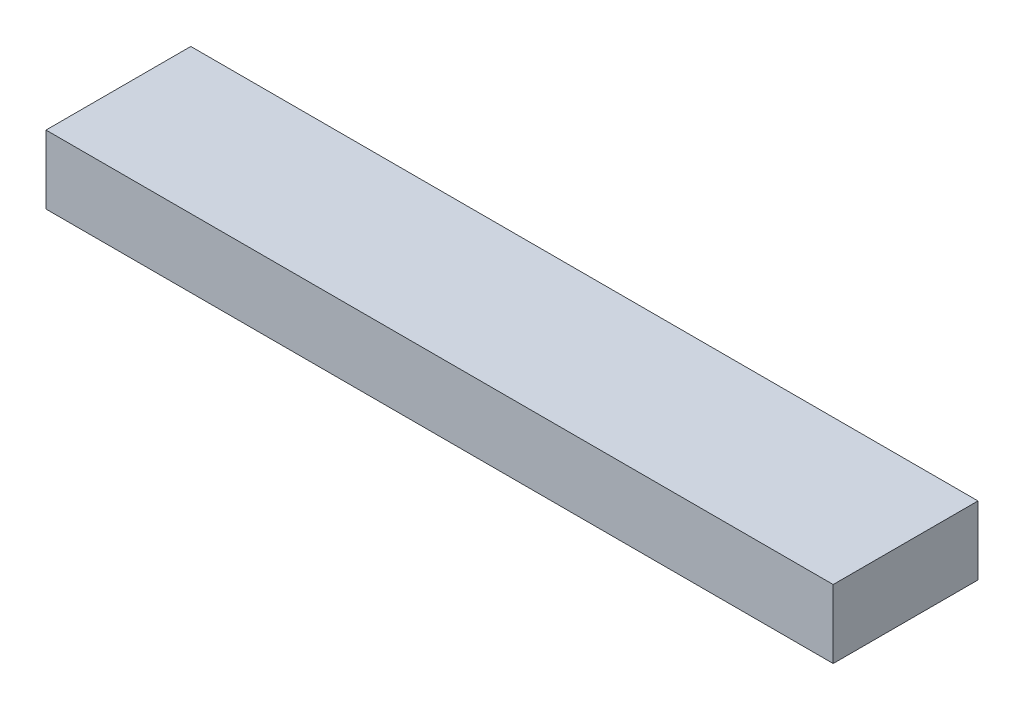
ISO-10303-21;
HEADER;
FILE_DESCRIPTION(('STEP AP214'),'2;1');
FILE_NAME('part.step','',(''),(''),'','','');
FILE_SCHEMA(('AUTOMOTIVE_DESIGN { 1 0 10303 214 1 1 1 1 }'));
ENDSEC;
DATA;
#1=APPLICATION_CONTEXT('core data for automotive mechanical design processes');
#2=APPLICATION_PROTOCOL_DEFINITION('international standard','automotive_design',2000,#1);
#3=PRODUCT_CONTEXT('',#1,'mechanical');
#4=PRODUCT('Part','Part','',(#3));
#5=PRODUCT_RELATED_PRODUCT_CATEGORY('part','',(#4));
#6=PRODUCT_DEFINITION_FORMATION('','',#4);
#7=PRODUCT_DEFINITION_CONTEXT('part definition',#1,'design');
#8=PRODUCT_DEFINITION('design','',#6,#7);
#9=PRODUCT_DEFINITION_SHAPE('','',#8);
#10=(LENGTH_UNIT() NAMED_UNIT(*) SI_UNIT(.MILLI.,.METRE.));
#11=(NAMED_UNIT(*) PLANE_ANGLE_UNIT() SI_UNIT($,.RADIAN.));
#12=(NAMED_UNIT(*) SI_UNIT($,.STERADIAN.) SOLID_ANGLE_UNIT());
#13=UNCERTAINTY_MEASURE_WITH_UNIT(LENGTH_MEASURE(1.E-05),#10,'distance_accuracy_value','');
#14=(GEOMETRIC_REPRESENTATION_CONTEXT(3) GLOBAL_UNCERTAINTY_ASSIGNED_CONTEXT((#13)) GLOBAL_UNIT_ASSIGNED_CONTEXT((#10,
#11,#12)) REPRESENTATION_CONTEXT('',''));
#15=CARTESIAN_POINT('',(0.,0.,0.));
#16=DIRECTION('',(0.,0.,1.));
#17=DIRECTION('',(1.,0.,0.));
#18=AXIS2_PLACEMENT_3D('',#15,#16,#17);
#19=CARTESIAN_POINT('',(149.5,-13.,55.));
#20=DIRECTION('',(-1.,0.,0.));
#21=DIRECTION('',(0.,0.,1.));
#22=AXIS2_PLACEMENT_3D('',#19,#20,#21);
#23=PLANE('',#22);
#24=DIRECTION('',(0.,1.,0.));
#25=VECTOR('',#24,1.);
#26=CARTESIAN_POINT('',(149.5,-13.,0.));
#27=LINE('',#26,#25);
#28=CARTESIAN_POINT('',(149.5,-13.,0.));
#29=VERTEX_POINT('',#28);
#30=CARTESIAN_POINT('',(149.5,13.,0.));
#31=VERTEX_POINT('',#30);
#32=EDGE_CURVE('E96',#29,#31,#27,.T.);
#33=ORIENTED_EDGE('',*,*,#32,.T.);
#34=DIRECTION('',(0.,0.,-1.));
#35=VECTOR('',#34,1.);
#36=CARTESIAN_POINT('',(149.5,13.,55.));
#37=LINE('',#36,#35);
#38=CARTESIAN_POINT('',(149.5,13.,55.));
#39=VERTEX_POINT('',#38);
#40=EDGE_CURVE('E11',#39,#31,#37,.T.);
#41=ORIENTED_EDGE('',*,*,#40,.F.);
#42=DIRECTION('',(0.,1.,0.));
#43=VECTOR('',#42,1.);
#44=CARTESIAN_POINT('',(149.5,-13.,55.));
#45=LINE('',#44,#43);
#46=CARTESIAN_POINT('',(149.5,-13.,55.));
#47=VERTEX_POINT('',#46);
#48=EDGE_CURVE('E84',#47,#39,#45,.T.);
#49=ORIENTED_EDGE('',*,*,#48,.F.);
#50=DIRECTION('',(0.,0.,-1.));
#51=VECTOR('',#50,1.);
#52=CARTESIAN_POINT('',(149.5,-13.,55.));
#53=LINE('',#52,#51);
#54=EDGE_CURVE('E92',#47,#29,#53,.T.);
#55=ORIENTED_EDGE('',*,*,#54,.T.);
#56=EDGE_LOOP('',(#33,#41,#49,#55));
#57=FACE_BOUND('',#56,.T.);
#58=ADVANCED_FACE('F33',(#57),#23,.F.);
#59=CARTESIAN_POINT('',(-149.5,13.,55.));
#60=DIRECTION('',(0.,-1.,0.));
#61=DIRECTION('',(0.,0.,-1.));
#62=AXIS2_PLACEMENT_3D('',#59,#60,#61);
#63=PLANE('',#62);
#64=DIRECTION('',(-1.,0.,0.));
#65=VECTOR('',#64,1.);
#66=CARTESIAN_POINT('',(-149.5,13.,0.));
#67=LINE('',#66,#65);
#68=CARTESIAN_POINT('',(-149.5,13.,0.));
#69=VERTEX_POINT('',#68);
#70=EDGE_CURVE('E88',#31,#69,#67,.T.);
#71=ORIENTED_EDGE('',*,*,#70,.T.);
#72=DIRECTION('',(0.,0.,-1.));
#73=VECTOR('',#72,1.);
#74=CARTESIAN_POINT('',(-149.5,13.,55.));
#75=LINE('',#74,#73);
#76=CARTESIAN_POINT('',(-149.5,13.,55.));
#77=VERTEX_POINT('',#76);
#78=EDGE_CURVE('E41',#77,#69,#75,.T.);
#79=ORIENTED_EDGE('',*,*,#78,.F.);
#80=DIRECTION('',(-1.,0.,0.));
#81=VECTOR('',#80,1.);
#82=CARTESIAN_POINT('',(-149.5,13.,55.));
#83=LINE('',#82,#81);
#84=EDGE_CURVE('E79',#39,#77,#83,.T.);
#85=ORIENTED_EDGE('',*,*,#84,.F.);
#86=ORIENTED_EDGE('',*,*,#40,.T.);
#87=EDGE_LOOP('',(#71,#79,#85,#86));
#88=FACE_BOUND('',#87,.T.);
#89=ADVANCED_FACE('F87',(#88),#63,.F.);
#90=CARTESIAN_POINT('',(-149.5,-13.,55.));
#91=DIRECTION('',(1.,0.,0.));
#92=DIRECTION('',(0.,0.,-1.));
#93=AXIS2_PLACEMENT_3D('',#90,#91,#92);
#94=PLANE('',#93);
#95=DIRECTION('',(0.,-1.,0.));
#96=VECTOR('',#95,1.);
#97=CARTESIAN_POINT('',(-149.5,-13.,0.));
#98=LINE('',#97,#96);
#99=CARTESIAN_POINT('',(-149.5,-13.,0.));
#100=VERTEX_POINT('',#99);
#101=EDGE_CURVE('E66',#69,#100,#98,.T.);
#102=ORIENTED_EDGE('',*,*,#101,.T.);
#103=DIRECTION('',(0.,0.,-1.));
#104=VECTOR('',#103,1.);
#105=CARTESIAN_POINT('',(-149.5,-13.,55.));
#106=LINE('',#105,#104);
#107=CARTESIAN_POINT('',(-149.5,-13.,55.));
#108=VERTEX_POINT('',#107);
#109=EDGE_CURVE('E89',#108,#100,#106,.T.);
#110=ORIENTED_EDGE('',*,*,#109,.F.);
#111=DIRECTION('',(0.,-1.,0.));
#112=VECTOR('',#111,1.);
#113=CARTESIAN_POINT('',(-149.5,-13.,55.));
#114=LINE('',#113,#112);
#115=EDGE_CURVE('E82',#77,#108,#114,.T.);
#116=ORIENTED_EDGE('',*,*,#115,.F.);
#117=ORIENTED_EDGE('',*,*,#78,.T.);
#118=EDGE_LOOP('',(#102,#110,#116,#117));
#119=FACE_BOUND('',#118,.T.);
#120=ADVANCED_FACE('F90',(#119),#94,.F.);
#121=CARTESIAN_POINT('',(-149.5,-13.,55.));
#122=DIRECTION('',(0.,1.,0.));
#123=DIRECTION('',(0.,0.,1.));
#124=AXIS2_PLACEMENT_3D('',#121,#122,#123);
#125=PLANE('',#124);
#126=DIRECTION('',(1.,0.,0.));
#127=VECTOR('',#126,1.);
#128=CARTESIAN_POINT('',(-149.5,-13.,0.));
#129=LINE('',#128,#127);
#130=EDGE_CURVE('E72',#100,#29,#129,.T.);
#131=ORIENTED_EDGE('',*,*,#130,.T.);
#132=ORIENTED_EDGE('',*,*,#54,.F.);
#133=DIRECTION('',(1.,0.,0.));
#134=VECTOR('',#133,1.);
#135=CARTESIAN_POINT('',(-149.5,-13.,55.));
#136=LINE('',#135,#134);
#137=EDGE_CURVE('E49',#108,#47,#136,.T.);
#138=ORIENTED_EDGE('',*,*,#137,.F.);
#139=ORIENTED_EDGE('',*,*,#109,.T.);
#140=EDGE_LOOP('',(#131,#132,#138,#139));
#141=FACE_BOUND('',#140,.T.);
#142=ADVANCED_FACE('F103',(#141),#125,.F.);
#143=CARTESIAN_POINT('',(149.5,13.,55.));
#144=DIRECTION('',(0.,0.,-1.));
#145=DIRECTION('',(-1.,0.,0.));
#146=AXIS2_PLACEMENT_3D('',#143,#144,#145);
#147=PLANE('',#146);
#148=ORIENTED_EDGE('',*,*,#48,.T.);
#149=ORIENTED_EDGE('',*,*,#84,.T.);
#150=ORIENTED_EDGE('',*,*,#115,.T.);
#151=ORIENTED_EDGE('',*,*,#137,.T.);
#152=EDGE_LOOP('',(#148,#149,#150,#151));
#153=FACE_BOUND('',#152,.T.);
#154=ADVANCED_FACE('F80',(#153),#147,.F.);
#155=CARTESIAN_POINT('',(149.5,13.,0.));
#156=DIRECTION('',(0.,0.,-1.));
#157=DIRECTION('',(-1.,0.,0.));
#158=AXIS2_PLACEMENT_3D('',#155,#156,#157);
#159=PLANE('',#158);
#160=ORIENTED_EDGE('',*,*,#32,.F.);
#161=ORIENTED_EDGE('',*,*,#130,.F.);
#162=ORIENTED_EDGE('',*,*,#101,.F.);
#163=ORIENTED_EDGE('',*,*,#70,.F.);
#164=EDGE_LOOP('',(#160,#161,#162,#163));
#165=FACE_BOUND('',#164,.T.);
#166=ADVANCED_FACE('F106',(#165),#159,.T.);
#167=CLOSED_SHELL('',(#58,#89,#120,#142,#154,#166));
#168=MANIFOLD_SOLID_BREP('B2',#167);
#169=ADVANCED_BREP_SHAPE_REPRESENTATION('',(#18,#168),#14);
#170=SHAPE_DEFINITION_REPRESENTATION(#9,#169);
ENDSEC;
END-ISO-10303-21;
